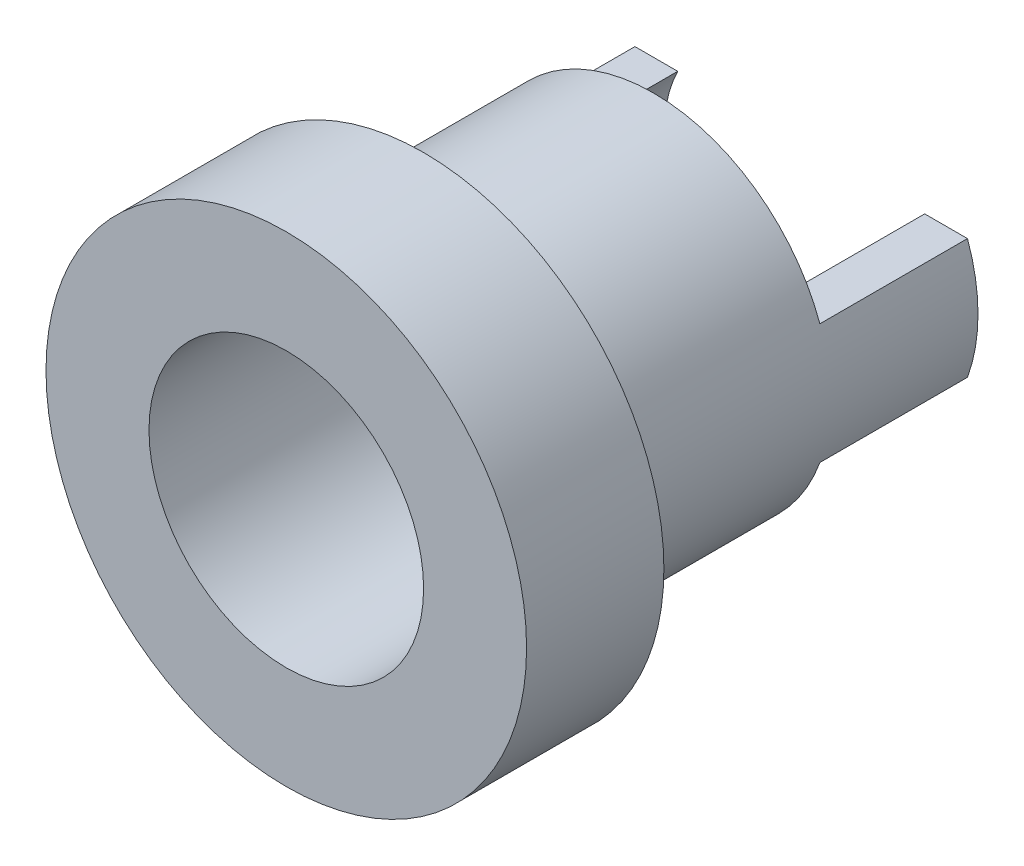
ISO-10303-21;
HEADER;
FILE_DESCRIPTION(('STEP AP214'),'2;1');
FILE_NAME('part.step','',(''),(''),'','','');
FILE_SCHEMA(('AUTOMOTIVE_DESIGN { 1 0 10303 214 1 1 1 1 }'));
ENDSEC;
DATA;
#1=APPLICATION_CONTEXT('core data for automotive mechanical design processes');
#2=APPLICATION_PROTOCOL_DEFINITION('international standard','automotive_design',2000,#1);
#3=PRODUCT_CONTEXT('',#1,'mechanical');
#4=PRODUCT('Part','Part','',(#3));
#5=PRODUCT_RELATED_PRODUCT_CATEGORY('part','',(#4));
#6=PRODUCT_DEFINITION_FORMATION('','',#4);
#7=PRODUCT_DEFINITION_CONTEXT('part definition',#1,'design');
#8=PRODUCT_DEFINITION('design','',#6,#7);
#9=PRODUCT_DEFINITION_SHAPE('','',#8);
#10=(LENGTH_UNIT() NAMED_UNIT(*) SI_UNIT(.MILLI.,.METRE.));
#11=(NAMED_UNIT(*) PLANE_ANGLE_UNIT() SI_UNIT($,.RADIAN.));
#12=(NAMED_UNIT(*) SI_UNIT($,.STERADIAN.) SOLID_ANGLE_UNIT());
#13=UNCERTAINTY_MEASURE_WITH_UNIT(LENGTH_MEASURE(1.E-05),#10,'distance_accuracy_value','');
#14=(GEOMETRIC_REPRESENTATION_CONTEXT(3) GLOBAL_UNCERTAINTY_ASSIGNED_CONTEXT((#13)) GLOBAL_UNIT_ASSIGNED_CONTEXT((#10,
#11,#12)) REPRESENTATION_CONTEXT('',''));
#15=CARTESIAN_POINT('',(0.,0.,0.));
#16=DIRECTION('',(0.,0.,1.));
#17=DIRECTION('',(1.,0.,0.));
#18=AXIS2_PLACEMENT_3D('',#15,#16,#17);
#19=CARTESIAN_POINT('',(0.,0.,-11.));
#20=DIRECTION('',(0.,0.,-1.));
#21=DIRECTION('',(-1.,0.,0.));
#22=AXIS2_PLACEMENT_3D('',#19,#20,#21);
#23=PLANE('',#22);
#24=DIRECTION('',(1.,0.,0.));
#25=VECTOR('',#24,1.);
#26=CARTESIAN_POINT('',(-7.,1.75,-11.));
#27=LINE('',#26,#25);
#28=CARTESIAN_POINT('',(3.59687364248454,1.75,-11.));
#29=VERTEX_POINT('',#28);
#30=CARTESIAN_POINT('',(4.84355241532493,1.75,-11.));
#31=VERTEX_POINT('',#30);
#32=EDGE_CURVE('E182',#29,#31,#27,.T.);
#33=ORIENTED_EDGE('',*,*,#32,.T.);
#34=CARTESIAN_POINT('',(0.,0.,-11.));
#35=DIRECTION('',(0.,0.,-1.));
#36=DIRECTION('',(-1.,0.,0.));
#37=AXIS2_PLACEMENT_3D('',#34,#35,#36);
#38=CIRCLE('',#37,5.15);
#39=CARTESIAN_POINT('',(4.84355241532493,-1.75,-11.));
#40=VERTEX_POINT('',#39);
#41=EDGE_CURVE('E133',#31,#40,#38,.T.);
#42=ORIENTED_EDGE('',*,*,#41,.T.);
#43=DIRECTION('',(1.,0.,0.));
#44=VECTOR('',#43,1.);
#45=CARTESIAN_POINT('',(-7.,-1.75,-11.));
#46=LINE('',#45,#44);
#47=CARTESIAN_POINT('',(3.59687364248454,-1.75,-11.));
#48=VERTEX_POINT('',#47);
#49=EDGE_CURVE('E124',#48,#40,#46,.T.);
#50=ORIENTED_EDGE('',*,*,#49,.F.);
#51=CARTESIAN_POINT('',(0.,0.,-11.));
#52=DIRECTION('',(0.,0.,-1.));
#53=DIRECTION('',(-1.,0.,0.));
#54=AXIS2_PLACEMENT_3D('',#51,#52,#53);
#55=CIRCLE('',#54,4.);
#56=EDGE_CURVE('E134',#29,#48,#55,.T.);
#57=ORIENTED_EDGE('',*,*,#56,.F.);
#58=EDGE_LOOP('',(#33,#42,#50,#57));
#59=FACE_BOUND('',#58,.T.);
#60=ADVANCED_FACE('F39',(#59),#23,.T.);
#61=CARTESIAN_POINT('',(0.,0.,4.));
#62=DIRECTION('',(0.,0.,-1.));
#63=DIRECTION('',(-1.,0.,0.));
#64=AXIS2_PLACEMENT_3D('',#61,#62,#63);
#65=CYLINDRICAL_SURFACE('',#64,7.);
#66=CARTESIAN_POINT('',(0.,0.,4.));
#67=DIRECTION('',(0.,0.,1.));
#68=DIRECTION('',(1.,0.,0.));
#69=AXIS2_PLACEMENT_3D('',#66,#67,#68);
#70=CIRCLE('',#69,7.);
#71=CARTESIAN_POINT('',(7.,0.,4.));
#72=VERTEX_POINT('',#71);
#73=EDGE_CURVE('E151',#72,#72,#70,.T.);
#74=ORIENTED_EDGE('',*,*,#73,.F.);
#75=EDGE_LOOP('',(#74));
#76=FACE_BOUND('',#75,.T.);
#77=CARTESIAN_POINT('',(0.,0.,0.));
#78=DIRECTION('',(0.,0.,1.));
#79=DIRECTION('',(1.,0.,0.));
#80=AXIS2_PLACEMENT_3D('',#77,#78,#79);
#81=CIRCLE('',#80,7.);
#82=CARTESIAN_POINT('',(7.,0.,0.));
#83=VERTEX_POINT('',#82);
#84=EDGE_CURVE('E139',#83,#83,#81,.T.);
#85=ORIENTED_EDGE('',*,*,#84,.T.);
#86=EDGE_LOOP('',(#85));
#87=FACE_BOUND('',#86,.T.);
#88=ADVANCED_FACE('F41',(#76,#87),#65,.T.);
#89=CARTESIAN_POINT('',(0.,0.,4.));
#90=DIRECTION('',(0.,0.,1.));
#91=DIRECTION('',(1.,0.,0.));
#92=AXIS2_PLACEMENT_3D('',#89,#90,#91);
#93=PLANE('',#92);
#94=CARTESIAN_POINT('',(0.,0.,4.));
#95=DIRECTION('',(0.,0.,-1.));
#96=DIRECTION('',(-1.,0.,0.));
#97=AXIS2_PLACEMENT_3D('',#94,#95,#96);
#98=CIRCLE('',#97,4.);
#99=CARTESIAN_POINT('',(-4.,0.,4.));
#100=VERTEX_POINT('',#99);
#101=EDGE_CURVE('E144',#100,#100,#98,.T.);
#102=ORIENTED_EDGE('',*,*,#101,.T.);
#103=EDGE_LOOP('',(#102));
#104=FACE_BOUND('',#103,.T.);
#105=ORIENTED_EDGE('',*,*,#73,.T.);
#106=EDGE_LOOP('',(#105));
#107=FACE_BOUND('',#106,.T.);
#108=ADVANCED_FACE('F206',(#104,#107),#93,.T.);
#109=CARTESIAN_POINT('',(0.,0.,0.));
#110=DIRECTION('',(0.,0.,1.));
#111=DIRECTION('',(1.,0.,0.));
#112=AXIS2_PLACEMENT_3D('',#109,#110,#111);
#113=PLANE('',#112);
#114=CARTESIAN_POINT('',(0.,0.,0.));
#115=DIRECTION('',(0.,0.,-1.));
#116=DIRECTION('',(-1.,0.,0.));
#117=AXIS2_PLACEMENT_3D('',#114,#115,#116);
#118=CIRCLE('',#117,5.15);
#119=CARTESIAN_POINT('',(-5.15,0.,0.));
#120=VERTEX_POINT('',#119);
#121=EDGE_CURVE('E146',#120,#120,#118,.T.);
#122=ORIENTED_EDGE('',*,*,#121,.F.);
#123=EDGE_LOOP('',(#122));
#124=FACE_BOUND('',#123,.T.);
#125=ORIENTED_EDGE('',*,*,#84,.F.);
#126=EDGE_LOOP('',(#125));
#127=FACE_BOUND('',#126,.T.);
#128=ADVANCED_FACE('F227',(#124,#127),#113,.F.);
#129=CARTESIAN_POINT('',(0.,0.,-11.));
#130=DIRECTION('',(0.,0.,1.));
#131=DIRECTION('',(1.,0.,0.));
#132=AXIS2_PLACEMENT_3D('',#129,#130,#131);
#133=CYLINDRICAL_SURFACE('',#132,5.15);
#134=ORIENTED_EDGE('',*,*,#41,.F.);
#135=DIRECTION('',(0.,0.,1.));
#136=VECTOR('',#135,1.);
#137=CARTESIAN_POINT('',(4.84355241532493,1.75,-11.));
#138=LINE('',#137,#136);
#139=CARTESIAN_POINT('',(4.84355241532494,1.75,-6.7));
#140=VERTEX_POINT('',#139);
#141=EDGE_CURVE('E199',#31,#140,#138,.T.);
#142=ORIENTED_EDGE('',*,*,#141,.T.);
#143=CARTESIAN_POINT('',(0.,0.,-6.7));
#144=DIRECTION('',(0.,0.,1.));
#145=DIRECTION('',(1.,0.,0.));
#146=AXIS2_PLACEMENT_3D('',#143,#144,#145);
#147=CIRCLE('',#146,5.15);
#148=CARTESIAN_POINT('',(-4.84355241532494,1.75,-6.7));
#149=VERTEX_POINT('',#148);
#150=EDGE_CURVE('E195',#140,#149,#147,.T.);
#151=ORIENTED_EDGE('',*,*,#150,.T.);
#152=DIRECTION('',(0.,0.,1.));
#153=VECTOR('',#152,1.);
#154=CARTESIAN_POINT('',(-4.84355241532493,1.75,-11.));
#155=LINE('',#154,#153);
#156=CARTESIAN_POINT('',(-4.84355241532494,1.75,-11.));
#157=VERTEX_POINT('',#156);
#158=EDGE_CURVE('E131',#149,#157,#155,.F.);
#159=ORIENTED_EDGE('',*,*,#158,.T.);
#160=CARTESIAN_POINT('',(-4.84355241532494,-1.75,-11.));
#161=VERTEX_POINT('',#160);
#162=EDGE_CURVE('E119',#161,#157,#38,.T.);
#163=ORIENTED_EDGE('',*,*,#162,.F.);
#164=DIRECTION('',(0.,0.,1.));
#165=VECTOR('',#164,1.);
#166=CARTESIAN_POINT('',(-4.84355241532493,-1.75,-11.));
#167=LINE('',#166,#165);
#168=CARTESIAN_POINT('',(-4.84355241532493,-1.75,-6.7));
#169=VERTEX_POINT('',#168);
#170=EDGE_CURVE('E104',#161,#169,#167,.T.);
#171=ORIENTED_EDGE('',*,*,#170,.T.);
#172=CARTESIAN_POINT('',(0.,0.,-6.7));
#173=DIRECTION('',(0.,0.,1.));
#174=DIRECTION('',(0.,-1.,0.));
#175=AXIS2_PLACEMENT_3D('',#172,#173,#174);
#176=CIRCLE('',#175,5.15);
#177=CARTESIAN_POINT('',(4.84355241532493,-1.75,-6.7));
#178=VERTEX_POINT('',#177);
#179=EDGE_CURVE('E111',#169,#178,#176,.T.);
#180=ORIENTED_EDGE('',*,*,#179,.T.);
#181=DIRECTION('',(0.,0.,1.));
#182=VECTOR('',#181,1.);
#183=CARTESIAN_POINT('',(4.84355241532493,-1.75,-11.));
#184=LINE('',#183,#182);
#185=EDGE_CURVE('E112',#178,#40,#184,.F.);
#186=ORIENTED_EDGE('',*,*,#185,.T.);
#187=EDGE_LOOP('',(#134,#142,#151,#159,#163,#171,#180,#186));
#188=FACE_BOUND('',#187,.T.);
#189=ORIENTED_EDGE('',*,*,#121,.T.);
#190=EDGE_LOOP('',(#189));
#191=FACE_BOUND('',#190,.T.);
#192=ADVANCED_FACE('F128',(#188,#191),#133,.T.);
#193=CARTESIAN_POINT('',(-3.59687364248454,1.75,-11.));
#194=VERTEX_POINT('',#193);
#195=EDGE_CURVE('E191',#157,#194,#27,.T.);
#196=ORIENTED_EDGE('',*,*,#195,.T.);
#197=CARTESIAN_POINT('',(-3.59687364248454,-1.75,-11.));
#198=VERTEX_POINT('',#197);
#199=EDGE_CURVE('E121',#198,#194,#55,.T.);
#200=ORIENTED_EDGE('',*,*,#199,.F.);
#201=EDGE_CURVE('E63',#161,#198,#46,.T.);
#202=ORIENTED_EDGE('',*,*,#201,.F.);
#203=ORIENTED_EDGE('',*,*,#162,.T.);
#204=EDGE_LOOP('',(#196,#200,#202,#203));
#205=FACE_BOUND('',#204,.T.);
#206=ADVANCED_FACE('F118',(#205),#23,.T.);
#207=CARTESIAN_POINT('',(0.,0.,4.));
#208=DIRECTION('',(0.,0.,-1.));
#209=DIRECTION('',(-1.,0.,0.));
#210=AXIS2_PLACEMENT_3D('',#207,#208,#209);
#211=CYLINDRICAL_SURFACE('',#210,4.);
#212=ORIENTED_EDGE('',*,*,#199,.T.);
#213=DIRECTION('',(0.,0.,-1.));
#214=VECTOR('',#213,1.);
#215=CARTESIAN_POINT('',(-3.59687364248454,1.75,4.));
#216=LINE('',#215,#214);
#217=CARTESIAN_POINT('',(-3.59687364248454,1.75,-6.7));
#218=VERTEX_POINT('',#217);
#219=EDGE_CURVE('E11',#194,#218,#216,.F.);
#220=ORIENTED_EDGE('',*,*,#219,.T.);
#221=CARTESIAN_POINT('',(0.,0.,-6.7));
#222=DIRECTION('',(0.,0.,1.));
#223=DIRECTION('',(1.,0.,0.));
#224=AXIS2_PLACEMENT_3D('',#221,#222,#223);
#225=CIRCLE('',#224,4.);
#226=CARTESIAN_POINT('',(3.59687364248454,1.75,-6.7));
#227=VERTEX_POINT('',#226);
#228=EDGE_CURVE('E169',#218,#227,#225,.F.);
#229=ORIENTED_EDGE('',*,*,#228,.T.);
#230=DIRECTION('',(0.,0.,-1.));
#231=VECTOR('',#230,1.);
#232=CARTESIAN_POINT('',(3.59687364248454,1.75,4.));
#233=LINE('',#232,#231);
#234=EDGE_CURVE('E48',#227,#29,#233,.T.);
#235=ORIENTED_EDGE('',*,*,#234,.T.);
#236=ORIENTED_EDGE('',*,*,#56,.T.);
#237=DIRECTION('',(0.,0.,-1.));
#238=VECTOR('',#237,1.);
#239=CARTESIAN_POINT('',(3.59687364248454,-1.75,4.));
#240=LINE('',#239,#238);
#241=CARTESIAN_POINT('',(3.59687364248454,-1.75,-6.7));
#242=VERTEX_POINT('',#241);
#243=EDGE_CURVE('E165',#48,#242,#240,.F.);
#244=ORIENTED_EDGE('',*,*,#243,.T.);
#245=CARTESIAN_POINT('',(0.,0.,-6.7));
#246=DIRECTION('',(0.,0.,1.));
#247=DIRECTION('',(0.,-1.,0.));
#248=AXIS2_PLACEMENT_3D('',#245,#246,#247);
#249=CIRCLE('',#248,4.);
#250=CARTESIAN_POINT('',(-3.59687364248454,-1.75,-6.7));
#251=VERTEX_POINT('',#250);
#252=EDGE_CURVE('E161',#242,#251,#249,.F.);
#253=ORIENTED_EDGE('',*,*,#252,.T.);
#254=DIRECTION('',(0.,0.,-1.));
#255=VECTOR('',#254,1.);
#256=CARTESIAN_POINT('',(-3.59687364248454,-1.75,4.));
#257=LINE('',#256,#255);
#258=EDGE_CURVE('E150',#251,#198,#257,.T.);
#259=ORIENTED_EDGE('',*,*,#258,.T.);
#260=EDGE_LOOP('',(#212,#220,#229,#235,#236,#244,#253,#259));
#261=FACE_BOUND('',#260,.T.);
#262=ORIENTED_EDGE('',*,*,#101,.F.);
#263=EDGE_LOOP('',(#262));
#264=FACE_BOUND('',#263,.T.);
#265=ADVANCED_FACE('F176',(#261,#264),#211,.F.);
#266=CARTESIAN_POINT('',(-7.,-5.15,-6.7));
#267=DIRECTION('',(0.,0.,1.));
#268=DIRECTION('',(0.,-1.,0.));
#269=AXIS2_PLACEMENT_3D('',#266,#267,#268);
#270=PLANE('',#269);
#271=ORIENTED_EDGE('',*,*,#179,.F.);
#272=DIRECTION('',(1.,0.,0.));
#273=VECTOR('',#272,1.);
#274=CARTESIAN_POINT('',(-7.,-1.75,-6.7));
#275=LINE('',#274,#273);
#276=EDGE_CURVE('E107',#169,#251,#275,.T.);
#277=ORIENTED_EDGE('',*,*,#276,.T.);
#278=ORIENTED_EDGE('',*,*,#252,.F.);
#279=EDGE_CURVE('E123',#242,#178,#275,.T.);
#280=ORIENTED_EDGE('',*,*,#279,.T.);
#281=EDGE_LOOP('',(#271,#277,#278,#280));
#282=FACE_BOUND('',#281,.T.);
#283=ADVANCED_FACE('F209',(#282),#270,.F.);
#284=CARTESIAN_POINT('',(-7.,-1.75,-11.));
#285=DIRECTION('',(0.,1.,0.));
#286=DIRECTION('',(0.,0.,1.));
#287=AXIS2_PLACEMENT_3D('',#284,#285,#286);
#288=PLANE('',#287);
#289=ORIENTED_EDGE('',*,*,#201,.T.);
#290=ORIENTED_EDGE('',*,*,#258,.F.);
#291=ORIENTED_EDGE('',*,*,#276,.F.);
#292=ORIENTED_EDGE('',*,*,#170,.F.);
#293=EDGE_LOOP('',(#289,#290,#291,#292));
#294=FACE_BOUND('',#293,.T.);
#295=ADVANCED_FACE('F105',(#294),#288,.F.);
#296=ORIENTED_EDGE('',*,*,#279,.F.);
#297=ORIENTED_EDGE('',*,*,#243,.F.);
#298=ORIENTED_EDGE('',*,*,#49,.T.);
#299=ORIENTED_EDGE('',*,*,#185,.F.);
#300=EDGE_LOOP('',(#296,#297,#298,#299));
#301=FACE_BOUND('',#300,.T.);
#302=ADVANCED_FACE('F268',(#301),#288,.F.);
#303=CARTESIAN_POINT('',(-7.,1.75,-11.));
#304=DIRECTION('',(0.,-1.,0.));
#305=DIRECTION('',(0.,0.,-1.));
#306=AXIS2_PLACEMENT_3D('',#303,#304,#305);
#307=PLANE('',#306);
#308=ORIENTED_EDGE('',*,*,#32,.F.);
#309=ORIENTED_EDGE('',*,*,#234,.F.);
#310=DIRECTION('',(1.,0.,0.));
#311=VECTOR('',#310,1.);
#312=CARTESIAN_POINT('',(-7.,1.75,-6.7));
#313=LINE('',#312,#311);
#314=EDGE_CURVE('E55',#227,#140,#313,.T.);
#315=ORIENTED_EDGE('',*,*,#314,.T.);
#316=ORIENTED_EDGE('',*,*,#141,.F.);
#317=EDGE_LOOP('',(#308,#309,#315,#316));
#318=FACE_BOUND('',#317,.T.);
#319=ADVANCED_FACE('F276',(#318),#307,.F.);
#320=EDGE_CURVE('E307',#149,#218,#313,.T.);
#321=ORIENTED_EDGE('',*,*,#320,.T.);
#322=ORIENTED_EDGE('',*,*,#219,.F.);
#323=ORIENTED_EDGE('',*,*,#195,.F.);
#324=ORIENTED_EDGE('',*,*,#158,.F.);
#325=EDGE_LOOP('',(#321,#322,#323,#324));
#326=FACE_BOUND('',#325,.T.);
#327=ADVANCED_FACE('F284',(#326),#307,.F.);
#328=CARTESIAN_POINT('',(-7.,5.15,-6.7));
#329=DIRECTION('',(0.,0.,1.));
#330=DIRECTION('',(1.,0.,0.));
#331=AXIS2_PLACEMENT_3D('',#328,#329,#330);
#332=PLANE('',#331);
#333=ORIENTED_EDGE('',*,*,#314,.F.);
#334=ORIENTED_EDGE('',*,*,#228,.F.);
#335=ORIENTED_EDGE('',*,*,#320,.F.);
#336=ORIENTED_EDGE('',*,*,#150,.F.);
#337=EDGE_LOOP('',(#333,#334,#335,#336));
#338=FACE_BOUND('',#337,.T.);
#339=ADVANCED_FACE('F293',(#338),#332,.F.);
#340=CLOSED_SHELL('',(#60,#88,#108,#128,#192,#206,#265,#283,#295,#302,#319,#327,#339));
#341=MANIFOLD_SOLID_BREP('B2',#340);
#342=ADVANCED_BREP_SHAPE_REPRESENTATION('',(#18,#341),#14);
#343=SHAPE_DEFINITION_REPRESENTATION(#9,#342);
ENDSEC;
END-ISO-10303-21;
